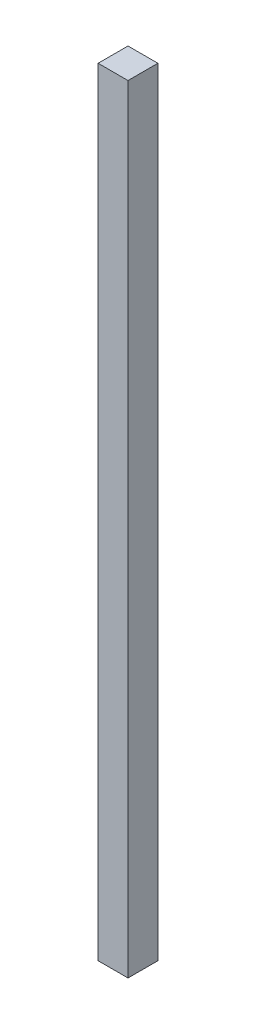
ISO-10303-21;
HEADER;
FILE_DESCRIPTION(('STEP AP214'),'2;1');
FILE_NAME('part.step','',(''),(''),'','','');
FILE_SCHEMA(('AUTOMOTIVE_DESIGN { 1 0 10303 214 1 1 1 1 }'));
ENDSEC;
DATA;
#1=APPLICATION_CONTEXT('core data for automotive mechanical design processes');
#2=APPLICATION_PROTOCOL_DEFINITION('international standard','automotive_design',2000,#1);
#3=PRODUCT_CONTEXT('',#1,'mechanical');
#4=PRODUCT('Part','Part','',(#3));
#5=PRODUCT_RELATED_PRODUCT_CATEGORY('part','',(#4));
#6=PRODUCT_DEFINITION_FORMATION('','',#4);
#7=PRODUCT_DEFINITION_CONTEXT('part definition',#1,'design');
#8=PRODUCT_DEFINITION('design','',#6,#7);
#9=PRODUCT_DEFINITION_SHAPE('','',#8);
#10=(LENGTH_UNIT() NAMED_UNIT(*) SI_UNIT(.MILLI.,.METRE.));
#11=(NAMED_UNIT(*) PLANE_ANGLE_UNIT() SI_UNIT($,.RADIAN.));
#12=(NAMED_UNIT(*) SI_UNIT($,.STERADIAN.) SOLID_ANGLE_UNIT());
#13=UNCERTAINTY_MEASURE_WITH_UNIT(LENGTH_MEASURE(1.E-05),#10,'distance_accuracy_value','');
#14=(GEOMETRIC_REPRESENTATION_CONTEXT(3) GLOBAL_UNCERTAINTY_ASSIGNED_CONTEXT((#13)) GLOBAL_UNIT_ASSIGNED_CONTEXT((#10,
#11,#12)) REPRESENTATION_CONTEXT('',''));
#15=CARTESIAN_POINT('',(0.,0.,0.));
#16=DIRECTION('',(0.,0.,1.));
#17=DIRECTION('',(1.,0.,0.));
#18=AXIS2_PLACEMENT_3D('',#15,#16,#17);
#19=CARTESIAN_POINT('',(-21.9866593567251,13.5277777777778,10.));
#20=DIRECTION('',(1.,0.,0.));
#21=DIRECTION('',(0.,1.,0.));
#22=AXIS2_PLACEMENT_3D('',#19,#20,#21);
#23=PLANE('',#22);
#24=DIRECTION('',(0.,-1.,0.));
#25=VECTOR('',#24,1.);
#26=CARTESIAN_POINT('',(-21.9866593567251,13.5277777777778,0.));
#27=LINE('',#26,#25);
#28=CARTESIAN_POINT('',(-21.9866593567251,13.5277777777778,0.));
#29=VERTEX_POINT('',#28);
#30=CARTESIAN_POINT('',(-21.9866593567251,-246.472222222222,0.));
#31=VERTEX_POINT('',#30);
#32=EDGE_CURVE('E96',#29,#31,#27,.T.);
#33=ORIENTED_EDGE('',*,*,#32,.T.);
#34=DIRECTION('',(0.,0.,-1.));
#35=VECTOR('',#34,1.);
#36=CARTESIAN_POINT('',(-21.9866593567251,-246.472222222222,10.));
#37=LINE('',#36,#35);
#38=CARTESIAN_POINT('',(-21.9866593567251,-246.472222222222,10.));
#39=VERTEX_POINT('',#38);
#40=EDGE_CURVE('E11',#39,#31,#37,.T.);
#41=ORIENTED_EDGE('',*,*,#40,.F.);
#42=DIRECTION('',(0.,-1.,0.));
#43=VECTOR('',#42,1.);
#44=CARTESIAN_POINT('',(-21.9866593567251,13.5277777777778,10.));
#45=LINE('',#44,#43);
#46=CARTESIAN_POINT('',(-21.9866593567251,13.5277777777778,10.));
#47=VERTEX_POINT('',#46);
#48=EDGE_CURVE('E84',#47,#39,#45,.T.);
#49=ORIENTED_EDGE('',*,*,#48,.F.);
#50=DIRECTION('',(0.,0.,-1.));
#51=VECTOR('',#50,1.);
#52=CARTESIAN_POINT('',(-21.9866593567251,13.5277777777778,10.));
#53=LINE('',#52,#51);
#54=EDGE_CURVE('E92',#47,#29,#53,.T.);
#55=ORIENTED_EDGE('',*,*,#54,.T.);
#56=EDGE_LOOP('',(#33,#41,#49,#55));
#57=FACE_BOUND('',#56,.T.);
#58=ADVANCED_FACE('F33',(#57),#23,.F.);
#59=CARTESIAN_POINT('',(-21.9866593567251,-246.472222222222,10.));
#60=DIRECTION('',(0.,1.,0.));
#61=DIRECTION('',(0.,0.,1.));
#62=AXIS2_PLACEMENT_3D('',#59,#60,#61);
#63=PLANE('',#62);
#64=DIRECTION('',(1.,0.,0.));
#65=VECTOR('',#64,1.);
#66=CARTESIAN_POINT('',(-21.9866593567251,-246.472222222222,0.));
#67=LINE('',#66,#65);
#68=CARTESIAN_POINT('',(-11.9866593567251,-246.472222222222,0.));
#69=VERTEX_POINT('',#68);
#70=EDGE_CURVE('E88',#31,#69,#67,.T.);
#71=ORIENTED_EDGE('',*,*,#70,.T.);
#72=DIRECTION('',(0.,0.,-1.));
#73=VECTOR('',#72,1.);
#74=CARTESIAN_POINT('',(-11.9866593567251,-246.472222222222,10.));
#75=LINE('',#74,#73);
#76=CARTESIAN_POINT('',(-11.9866593567251,-246.472222222222,10.));
#77=VERTEX_POINT('',#76);
#78=EDGE_CURVE('E41',#77,#69,#75,.T.);
#79=ORIENTED_EDGE('',*,*,#78,.F.);
#80=DIRECTION('',(1.,0.,0.));
#81=VECTOR('',#80,1.);
#82=CARTESIAN_POINT('',(-21.9866593567251,-246.472222222222,10.));
#83=LINE('',#82,#81);
#84=EDGE_CURVE('E79',#39,#77,#83,.T.);
#85=ORIENTED_EDGE('',*,*,#84,.F.);
#86=ORIENTED_EDGE('',*,*,#40,.T.);
#87=EDGE_LOOP('',(#71,#79,#85,#86));
#88=FACE_BOUND('',#87,.T.);
#89=ADVANCED_FACE('F87',(#88),#63,.F.);
#90=CARTESIAN_POINT('',(-11.9866593567251,13.5277777777778,10.));
#91=DIRECTION('',(-1.,0.,0.));
#92=DIRECTION('',(0.,-1.,0.));
#93=AXIS2_PLACEMENT_3D('',#90,#91,#92);
#94=PLANE('',#93);
#95=DIRECTION('',(0.,1.,0.));
#96=VECTOR('',#95,1.);
#97=CARTESIAN_POINT('',(-11.9866593567251,13.5277777777778,0.));
#98=LINE('',#97,#96);
#99=CARTESIAN_POINT('',(-11.9866593567251,13.5277777777778,0.));
#100=VERTEX_POINT('',#99);
#101=EDGE_CURVE('E66',#69,#100,#98,.T.);
#102=ORIENTED_EDGE('',*,*,#101,.T.);
#103=DIRECTION('',(0.,0.,-1.));
#104=VECTOR('',#103,1.);
#105=CARTESIAN_POINT('',(-11.9866593567251,13.5277777777778,10.));
#106=LINE('',#105,#104);
#107=CARTESIAN_POINT('',(-11.9866593567251,13.5277777777778,10.));
#108=VERTEX_POINT('',#107);
#109=EDGE_CURVE('E89',#108,#100,#106,.T.);
#110=ORIENTED_EDGE('',*,*,#109,.F.);
#111=DIRECTION('',(0.,1.,0.));
#112=VECTOR('',#111,1.);
#113=CARTESIAN_POINT('',(-11.9866593567251,13.5277777777778,10.));
#114=LINE('',#113,#112);
#115=EDGE_CURVE('E82',#77,#108,#114,.T.);
#116=ORIENTED_EDGE('',*,*,#115,.F.);
#117=ORIENTED_EDGE('',*,*,#78,.T.);
#118=EDGE_LOOP('',(#102,#110,#116,#117));
#119=FACE_BOUND('',#118,.T.);
#120=ADVANCED_FACE('F90',(#119),#94,.F.);
#121=CARTESIAN_POINT('',(-21.9866593567251,13.5277777777778,10.));
#122=DIRECTION('',(0.,-1.,0.));
#123=DIRECTION('',(0.,0.,-1.));
#124=AXIS2_PLACEMENT_3D('',#121,#122,#123);
#125=PLANE('',#124);
#126=DIRECTION('',(-1.,0.,0.));
#127=VECTOR('',#126,1.);
#128=CARTESIAN_POINT('',(-21.9866593567251,13.5277777777778,0.));
#129=LINE('',#128,#127);
#130=EDGE_CURVE('E72',#100,#29,#129,.T.);
#131=ORIENTED_EDGE('',*,*,#130,.T.);
#132=ORIENTED_EDGE('',*,*,#54,.F.);
#133=DIRECTION('',(-1.,0.,0.));
#134=VECTOR('',#133,1.);
#135=CARTESIAN_POINT('',(-21.9866593567251,13.5277777777778,10.));
#136=LINE('',#135,#134);
#137=EDGE_CURVE('E49',#108,#47,#136,.T.);
#138=ORIENTED_EDGE('',*,*,#137,.F.);
#139=ORIENTED_EDGE('',*,*,#109,.T.);
#140=EDGE_LOOP('',(#131,#132,#138,#139));
#141=FACE_BOUND('',#140,.T.);
#142=ADVANCED_FACE('F103',(#141),#125,.F.);
#143=CARTESIAN_POINT('',(0.,0.,10.));
#144=DIRECTION('',(0.,0.,1.));
#145=DIRECTION('',(1.,0.,0.));
#146=AXIS2_PLACEMENT_3D('',#143,#144,#145);
#147=PLANE('',#146);
#148=ORIENTED_EDGE('',*,*,#48,.T.);
#149=ORIENTED_EDGE('',*,*,#84,.T.);
#150=ORIENTED_EDGE('',*,*,#115,.T.);
#151=ORIENTED_EDGE('',*,*,#137,.T.);
#152=EDGE_LOOP('',(#148,#149,#150,#151));
#153=FACE_BOUND('',#152,.T.);
#154=ADVANCED_FACE('F80',(#153),#147,.T.);
#155=CARTESIAN_POINT('',(0.,0.,0.));
#156=DIRECTION('',(0.,0.,1.));
#157=DIRECTION('',(1.,0.,0.));
#158=AXIS2_PLACEMENT_3D('',#155,#156,#157);
#159=PLANE('',#158);
#160=ORIENTED_EDGE('',*,*,#32,.F.);
#161=ORIENTED_EDGE('',*,*,#130,.F.);
#162=ORIENTED_EDGE('',*,*,#101,.F.);
#163=ORIENTED_EDGE('',*,*,#70,.F.);
#164=EDGE_LOOP('',(#160,#161,#162,#163));
#165=FACE_BOUND('',#164,.T.);
#166=ADVANCED_FACE('F106',(#165),#159,.F.);
#167=CLOSED_SHELL('',(#58,#89,#120,#142,#154,#166));
#168=MANIFOLD_SOLID_BREP('B2',#167);
#169=ADVANCED_BREP_SHAPE_REPRESENTATION('',(#18,#168),#14);
#170=SHAPE_DEFINITION_REPRESENTATION(#9,#169);
ENDSEC;
END-ISO-10303-21;
